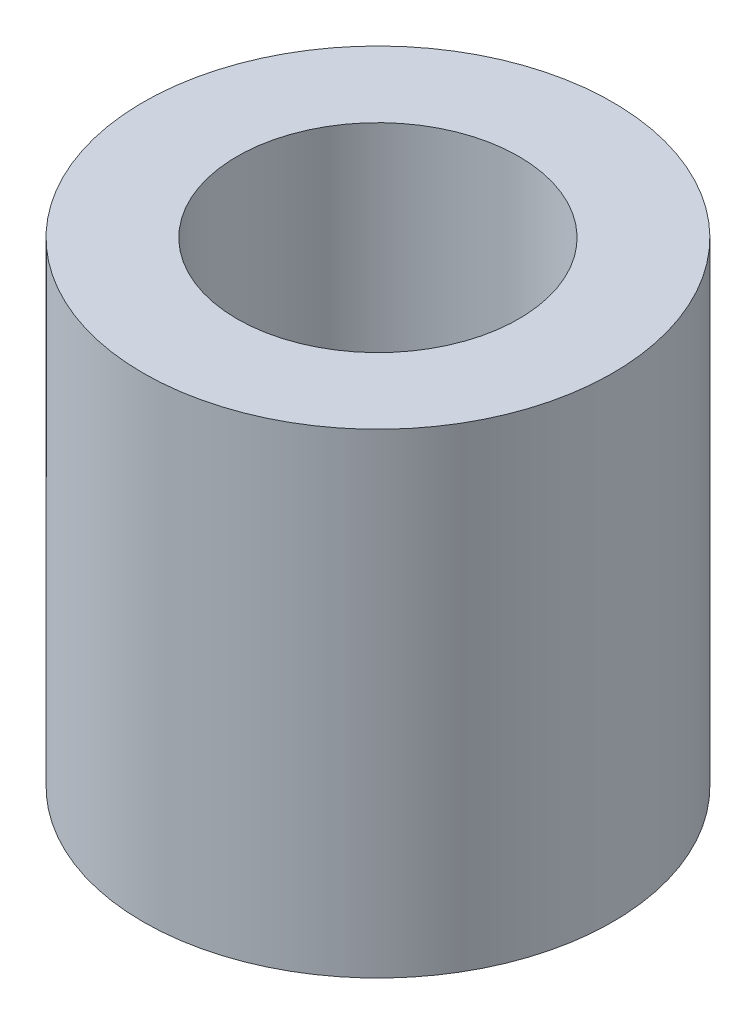
ISO-10303-21;
HEADER;
FILE_DESCRIPTION(('STEP AP214'),'2;1');
FILE_NAME('part.step','',(''),(''),'','','');
FILE_SCHEMA(('AUTOMOTIVE_DESIGN { 1 0 10303 214 1 1 1 1 }'));
ENDSEC;
DATA;
#1=APPLICATION_CONTEXT('core data for automotive mechanical design processes');
#2=APPLICATION_PROTOCOL_DEFINITION('international standard','automotive_design',2000,#1);
#3=PRODUCT_CONTEXT('',#1,'mechanical');
#4=PRODUCT('Part','Part','',(#3));
#5=PRODUCT_RELATED_PRODUCT_CATEGORY('part','',(#4));
#6=PRODUCT_DEFINITION_FORMATION('','',#4);
#7=PRODUCT_DEFINITION_CONTEXT('part definition',#1,'design');
#8=PRODUCT_DEFINITION('design','',#6,#7);
#9=PRODUCT_DEFINITION_SHAPE('','',#8);
#10=(LENGTH_UNIT() NAMED_UNIT(*) SI_UNIT(.MILLI.,.METRE.));
#11=(NAMED_UNIT(*) PLANE_ANGLE_UNIT() SI_UNIT($,.RADIAN.));
#12=(NAMED_UNIT(*) SI_UNIT($,.STERADIAN.) SOLID_ANGLE_UNIT());
#13=UNCERTAINTY_MEASURE_WITH_UNIT(LENGTH_MEASURE(1.E-05),#10,'distance_accuracy_value','');
#14=(GEOMETRIC_REPRESENTATION_CONTEXT(3) GLOBAL_UNCERTAINTY_ASSIGNED_CONTEXT((#13)) GLOBAL_UNIT_ASSIGNED_CONTEXT((#10,
#11,#12)) REPRESENTATION_CONTEXT('',''));
#15=CARTESIAN_POINT('',(0.,0.,0.));
#16=DIRECTION('',(0.,0.,1.));
#17=DIRECTION('',(1.,0.,0.));
#18=AXIS2_PLACEMENT_3D('',#15,#16,#17);
#19=CARTESIAN_POINT('',(0.,9.,0.));
#20=DIRECTION('',(0.,1.,0.));
#21=DIRECTION('',(0.,0.,1.));
#22=AXIS2_PLACEMENT_3D('',#19,#20,#21);
#23=PLANE('',#22);
#24=CARTESIAN_POINT('',(0.,9.,0.));
#25=DIRECTION('',(0.,1.,0.));
#26=DIRECTION('',(0.,0.,1.));
#27=AXIS2_PLACEMENT_3D('',#24,#25,#26);
#28=CIRCLE('',#27,4.445);
#29=CARTESIAN_POINT('',(0.,9.,4.445));
#30=VERTEX_POINT('',#29);
#31=EDGE_CURVE('E10',#30,#30,#28,.T.);
#32=ORIENTED_EDGE('',*,*,#31,.T.);
#33=EDGE_LOOP('',(#32));
#34=FACE_BOUND('',#33,.T.);
#35=CARTESIAN_POINT('',(0.,9.,0.));
#36=DIRECTION('',(0.,1.,0.));
#37=DIRECTION('',(0.,0.,1.));
#38=AXIS2_PLACEMENT_3D('',#35,#36,#37);
#39=CIRCLE('',#38,2.667);
#40=CARTESIAN_POINT('',(0.,9.,2.667));
#41=VERTEX_POINT('',#40);
#42=EDGE_CURVE('E42',#41,#41,#39,.T.);
#43=ORIENTED_EDGE('',*,*,#42,.F.);
#44=EDGE_LOOP('',(#43));
#45=FACE_BOUND('',#44,.T.);
#46=ADVANCED_FACE('F31',(#34,#45),#23,.T.);
#47=CARTESIAN_POINT('',(0.,0.,0.));
#48=DIRECTION('',(0.,1.,0.));
#49=DIRECTION('',(0.,0.,1.));
#50=AXIS2_PLACEMENT_3D('',#47,#48,#49);
#51=PLANE('',#50);
#52=CARTESIAN_POINT('',(0.,0.,0.));
#53=DIRECTION('',(0.,1.,0.));
#54=DIRECTION('',(0.,0.,1.));
#55=AXIS2_PLACEMENT_3D('',#52,#53,#54);
#56=CIRCLE('',#55,4.445);
#57=CARTESIAN_POINT('',(0.,0.,4.445));
#58=VERTEX_POINT('',#57);
#59=EDGE_CURVE('E35',#58,#58,#56,.T.);
#60=ORIENTED_EDGE('',*,*,#59,.F.);
#61=EDGE_LOOP('',(#60));
#62=FACE_BOUND('',#61,.T.);
#63=CARTESIAN_POINT('',(0.,0.,0.));
#64=DIRECTION('',(0.,1.,0.));
#65=DIRECTION('',(0.,0.,1.));
#66=AXIS2_PLACEMENT_3D('',#63,#64,#65);
#67=CIRCLE('',#66,2.667);
#68=CARTESIAN_POINT('',(0.,0.,2.667));
#69=VERTEX_POINT('',#68);
#70=EDGE_CURVE('E44',#69,#69,#67,.T.);
#71=ORIENTED_EDGE('',*,*,#70,.T.);
#72=EDGE_LOOP('',(#71));
#73=FACE_BOUND('',#72,.T.);
#74=ADVANCED_FACE('F54',(#62,#73),#51,.F.);
#75=CARTESIAN_POINT('',(0.,9.,0.));
#76=DIRECTION('',(0.,-1.,0.));
#77=DIRECTION('',(0.,0.,-1.));
#78=AXIS2_PLACEMENT_3D('',#75,#76,#77);
#79=CYLINDRICAL_SURFACE('',#78,4.445);
#80=ORIENTED_EDGE('',*,*,#31,.F.);
#81=EDGE_LOOP('',(#80));
#82=FACE_BOUND('',#81,.T.);
#83=ORIENTED_EDGE('',*,*,#59,.T.);
#84=EDGE_LOOP('',(#83));
#85=FACE_BOUND('',#84,.T.);
#86=ADVANCED_FACE('F33',(#82,#85),#79,.T.);
#87=CARTESIAN_POINT('',(0.,9.,0.));
#88=DIRECTION('',(0.,-1.,0.));
#89=DIRECTION('',(0.,0.,-1.));
#90=AXIS2_PLACEMENT_3D('',#87,#88,#89);
#91=CYLINDRICAL_SURFACE('',#90,2.667);
#92=ORIENTED_EDGE('',*,*,#42,.T.);
#93=EDGE_LOOP('',(#92));
#94=FACE_BOUND('',#93,.T.);
#95=ORIENTED_EDGE('',*,*,#70,.F.);
#96=EDGE_LOOP('',(#95));
#97=FACE_BOUND('',#96,.T.);
#98=ADVANCED_FACE('F50',(#94,#97),#91,.F.);
#99=CLOSED_SHELL('',(#46,#74,#86,#98));
#100=MANIFOLD_SOLID_BREP('B2',#99);
#101=ADVANCED_BREP_SHAPE_REPRESENTATION('',(#18,#100),#14);
#102=SHAPE_DEFINITION_REPRESENTATION(#9,#101);
ENDSEC;
END-ISO-10303-21;
